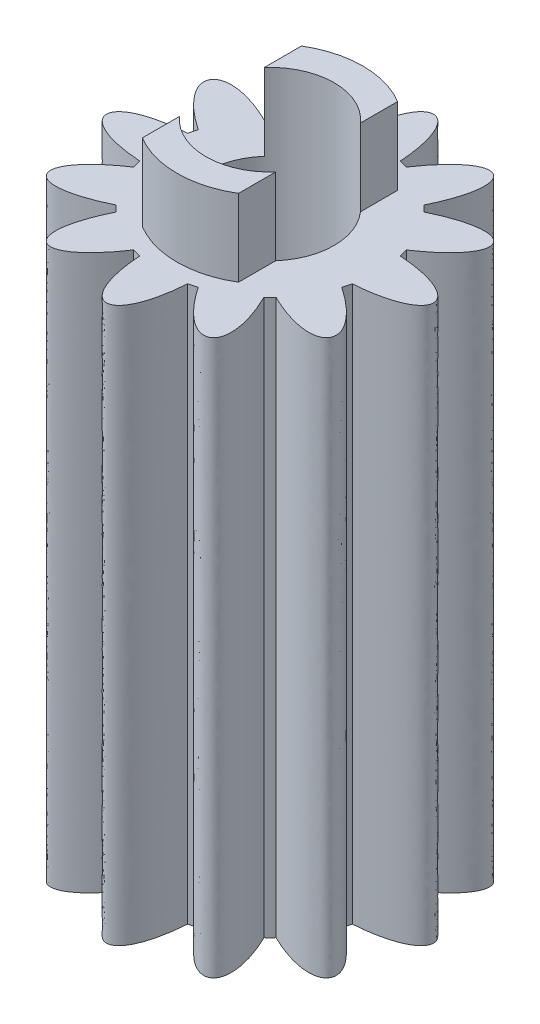
ISO-10303-21;
HEADER;
FILE_DESCRIPTION(('STEP AP214'),'2;1');
FILE_NAME('part.step','',(''),(''),'','','');
FILE_SCHEMA(('AUTOMOTIVE_DESIGN { 1 0 10303 214 1 1 1 1 }'));
ENDSEC;
DATA;
#1=APPLICATION_CONTEXT('core data for automotive mechanical design processes');
#2=APPLICATION_PROTOCOL_DEFINITION('international standard','automotive_design',2000,#1);
#3=PRODUCT_CONTEXT('',#1,'mechanical');
#4=PRODUCT('Part','Part','',(#3));
#5=PRODUCT_RELATED_PRODUCT_CATEGORY('part','',(#4));
#6=PRODUCT_DEFINITION_FORMATION('','',#4);
#7=PRODUCT_DEFINITION_CONTEXT('part definition',#1,'design');
#8=PRODUCT_DEFINITION('design','',#6,#7);
#9=PRODUCT_DEFINITION_SHAPE('','',#8);
#10=(LENGTH_UNIT() NAMED_UNIT(*) SI_UNIT(.MILLI.,.METRE.));
#11=(NAMED_UNIT(*) PLANE_ANGLE_UNIT() SI_UNIT($,.RADIAN.));
#12=(NAMED_UNIT(*) SI_UNIT($,.STERADIAN.) SOLID_ANGLE_UNIT());
#13=UNCERTAINTY_MEASURE_WITH_UNIT(LENGTH_MEASURE(1.E-05),#10,'distance_accuracy_value','');
#14=(GEOMETRIC_REPRESENTATION_CONTEXT(3) GLOBAL_UNCERTAINTY_ASSIGNED_CONTEXT((#13)) GLOBAL_UNIT_ASSIGNED_CONTEXT((#10,
#11,#12)) REPRESENTATION_CONTEXT('',''));
#15=CARTESIAN_POINT('',(0.,0.,0.));
#16=DIRECTION('',(0.,0.,1.));
#17=DIRECTION('',(1.,0.,0.));
#18=AXIS2_PLACEMENT_3D('',#15,#16,#17);
#19=CARTESIAN_POINT('',(0.,19.7,0.));
#20=DIRECTION('',(0.,-1.,0.));
#21=DIRECTION('',(0.,0.,-1.));
#22=AXIS2_PLACEMENT_3D('',#19,#20,#21);
#23=CYLINDRICAL_SURFACE('',#22,2.9);
#24=DIRECTION('',(0.,-1.,0.));
#25=VECTOR('',#24,1.);
#26=CARTESIAN_POINT('',(-1.5,19.7,-2.48193472919817));
#27=LINE('',#26,#25);
#28=CARTESIAN_POINT('',(-1.5,19.7,-2.48193472919817));
#29=VERTEX_POINT('',#28);
#30=CARTESIAN_POINT('',(-1.5,17.3,-2.48193472919817));
#31=VERTEX_POINT('',#30);
#32=EDGE_CURVE('E614',#29,#31,#27,.T.);
#33=ORIENTED_EDGE('',*,*,#32,.F.);
#34=CARTESIAN_POINT('',(0.,19.7,0.));
#35=DIRECTION('',(0.,1.,0.));
#36=DIRECTION('',(0.,0.,1.));
#37=AXIS2_PLACEMENT_3D('',#34,#35,#36);
#38=CIRCLE('',#37,2.9);
#39=CARTESIAN_POINT('',(1.5,19.7,-2.48193472919817));
#40=VERTEX_POINT('',#39);
#41=EDGE_CURVE('E261',#40,#29,#38,.T.);
#42=ORIENTED_EDGE('',*,*,#41,.F.);
#43=DIRECTION('',(0.,-1.,0.));
#44=VECTOR('',#43,1.);
#45=CARTESIAN_POINT('',(1.5,19.7,-2.48193472919817));
#46=LINE('',#45,#44);
#47=CARTESIAN_POINT('',(1.5,17.3,-2.48193472919817));
#48=VERTEX_POINT('',#47);
#49=EDGE_CURVE('E247',#48,#40,#46,.F.);
#50=ORIENTED_EDGE('',*,*,#49,.F.);
#51=CARTESIAN_POINT('',(0.,17.3,0.));
#52=DIRECTION('',(0.,1.,0.));
#53=DIRECTION('',(0.,0.,1.));
#54=AXIS2_PLACEMENT_3D('',#51,#52,#53);
#55=CIRCLE('',#54,2.9);
#56=EDGE_CURVE('E259',#48,#31,#55,.T.);
#57=ORIENTED_EDGE('',*,*,#56,.T.);
#58=EDGE_LOOP('',(#33,#42,#50,#57));
#59=FACE_BOUND('',#58,.T.);
#60=ADVANCED_FACE('F39',(#59),#23,.T.);
#61=DIRECTION('',(0.,-1.,0.));
#62=VECTOR('',#61,1.);
#63=CARTESIAN_POINT('',(-1.5,19.7,2.48193472919817));
#64=LINE('',#63,#62);
#65=CARTESIAN_POINT('',(-1.5,17.3,2.48193472919817));
#66=VERTEX_POINT('',#65);
#67=CARTESIAN_POINT('',(-1.5,19.7,2.48193472919817));
#68=VERTEX_POINT('',#67);
#69=EDGE_CURVE('E624',#66,#68,#64,.F.);
#70=ORIENTED_EDGE('',*,*,#69,.F.);
#71=CARTESIAN_POINT('',(1.5,17.3,2.48193472919817));
#72=VERTEX_POINT('',#71);
#73=EDGE_CURVE('E270',#66,#72,#55,.T.);
#74=ORIENTED_EDGE('',*,*,#73,.T.);
#75=DIRECTION('',(0.,-1.,0.));
#76=VECTOR('',#75,1.);
#77=CARTESIAN_POINT('',(1.5,19.7,2.48193472919817));
#78=LINE('',#77,#76);
#79=CARTESIAN_POINT('',(1.5,19.7,2.48193472919817));
#80=VERTEX_POINT('',#79);
#81=EDGE_CURVE('E262',#80,#72,#78,.T.);
#82=ORIENTED_EDGE('',*,*,#81,.F.);
#83=EDGE_CURVE('E277',#68,#80,#38,.T.);
#84=ORIENTED_EDGE('',*,*,#83,.F.);
#85=EDGE_LOOP('',(#70,#74,#82,#84));
#86=FACE_BOUND('',#85,.T.);
#87=ADVANCED_FACE('F737',(#86),#23,.T.);
#88=CARTESIAN_POINT('',(0.,19.7,0.));
#89=DIRECTION('',(0.,1.,0.));
#90=DIRECTION('',(0.,0.,1.));
#91=AXIS2_PLACEMENT_3D('',#88,#89,#90);
#92=PLANE('',#91);
#93=ORIENTED_EDGE('',*,*,#41,.T.);
#94=DIRECTION('',(0.,0.,-1.));
#95=VECTOR('',#94,1.);
#96=CARTESIAN_POINT('',(-1.5,19.7,-6.));
#97=LINE('',#96,#95);
#98=CARTESIAN_POINT('',(-1.5,19.7,-1.3228756555323));
#99=VERTEX_POINT('',#98);
#100=EDGE_CURVE('E616',#99,#29,#97,.T.);
#101=ORIENTED_EDGE('',*,*,#100,.F.);
#102=CARTESIAN_POINT('',(0.,19.7,0.));
#103=DIRECTION('',(0.,-1.,0.));
#104=DIRECTION('',(0.,0.,-1.));
#105=AXIS2_PLACEMENT_3D('',#102,#103,#104);
#106=CIRCLE('',#105,2.);
#107=CARTESIAN_POINT('',(1.5,19.7,-1.3228756555323));
#108=VERTEX_POINT('',#107);
#109=EDGE_CURVE('E628',#99,#108,#106,.T.);
#110=ORIENTED_EDGE('',*,*,#109,.T.);
#111=DIRECTION('',(0.,0.,1.));
#112=VECTOR('',#111,1.);
#113=CARTESIAN_POINT('',(1.5,19.7,-6.));
#114=LINE('',#113,#112);
#115=EDGE_CURVE('E620',#40,#108,#114,.T.);
#116=ORIENTED_EDGE('',*,*,#115,.F.);
#117=EDGE_LOOP('',(#93,#101,#110,#116));
#118=FACE_BOUND('',#117,.T.);
#119=ADVANCED_FACE('F742',(#118),#92,.T.);
#120=CARTESIAN_POINT('',(1.5,19.7,1.3228756555323));
#121=VERTEX_POINT('',#120);
#122=CARTESIAN_POINT('',(-1.5,19.7,1.3228756555323));
#123=VERTEX_POINT('',#122);
#124=EDGE_CURVE('E630',#121,#123,#106,.T.);
#125=ORIENTED_EDGE('',*,*,#124,.T.);
#126=EDGE_CURVE('E263',#68,#123,#97,.T.);
#127=ORIENTED_EDGE('',*,*,#126,.F.);
#128=ORIENTED_EDGE('',*,*,#83,.T.);
#129=EDGE_CURVE('E621',#121,#80,#114,.T.);
#130=ORIENTED_EDGE('',*,*,#129,.F.);
#131=EDGE_LOOP('',(#125,#127,#128,#130));
#132=FACE_BOUND('',#131,.T.);
#133=ADVANCED_FACE('F824',(#132),#92,.T.);
#134=CARTESIAN_POINT('',(0.,19.7,0.));
#135=DIRECTION('',(0.,-1.,0.));
#136=DIRECTION('',(0.,0.,-1.));
#137=AXIS2_PLACEMENT_3D('',#134,#135,#136);
#138=CYLINDRICAL_SURFACE('',#137,2.);
#139=CARTESIAN_POINT('',(0.,0.,0.));
#140=DIRECTION('',(0.,-1.,0.));
#141=DIRECTION('',(0.,0.,-1.));
#142=AXIS2_PLACEMENT_3D('',#139,#140,#141);
#143=CIRCLE('',#142,2.);
#144=CARTESIAN_POINT('',(0.,0.,-2.));
#145=VERTEX_POINT('',#144);
#146=EDGE_CURVE('E627',#145,#145,#143,.T.);
#147=ORIENTED_EDGE('',*,*,#146,.T.);
#148=EDGE_LOOP('',(#147));
#149=FACE_BOUND('',#148,.T.);
#150=DIRECTION('',(0.,-1.,0.));
#151=VECTOR('',#150,1.);
#152=CARTESIAN_POINT('',(-1.5,19.7,-1.3228756555323));
#153=LINE('',#152,#151);
#154=CARTESIAN_POINT('',(-1.5,17.3,-1.3228756555323));
#155=VERTEX_POINT('',#154);
#156=EDGE_CURVE('E11',#155,#99,#153,.F.);
#157=ORIENTED_EDGE('',*,*,#156,.F.);
#158=CARTESIAN_POINT('',(0.,17.3,0.));
#159=DIRECTION('',(0.,-1.,0.));
#160=DIRECTION('',(0.,0.,-1.));
#161=AXIS2_PLACEMENT_3D('',#158,#159,#160);
#162=CIRCLE('',#161,2.);
#163=CARTESIAN_POINT('',(-1.5,17.3,1.3228756555323));
#164=VERTEX_POINT('',#163);
#165=EDGE_CURVE('E598',#155,#164,#162,.F.);
#166=ORIENTED_EDGE('',*,*,#165,.T.);
#167=DIRECTION('',(0.,-1.,0.));
#168=VECTOR('',#167,1.);
#169=CARTESIAN_POINT('',(-1.5,19.7,1.3228756555323));
#170=LINE('',#169,#168);
#171=EDGE_CURVE('E48',#123,#164,#170,.T.);
#172=ORIENTED_EDGE('',*,*,#171,.F.);
#173=ORIENTED_EDGE('',*,*,#124,.F.);
#174=DIRECTION('',(0.,-1.,0.));
#175=VECTOR('',#174,1.);
#176=CARTESIAN_POINT('',(1.5,19.7,1.3228756555323));
#177=LINE('',#176,#175);
#178=CARTESIAN_POINT('',(1.5,17.3,1.3228756555323));
#179=VERTEX_POINT('',#178);
#180=EDGE_CURVE('E596',#179,#121,#177,.F.);
#181=ORIENTED_EDGE('',*,*,#180,.F.);
#182=CARTESIAN_POINT('',(0.,17.3,0.));
#183=DIRECTION('',(0.,-1.,0.));
#184=DIRECTION('',(0.,0.,-1.));
#185=AXIS2_PLACEMENT_3D('',#182,#183,#184);
#186=CIRCLE('',#185,2.);
#187=CARTESIAN_POINT('',(1.5,17.3,-1.3228756555323));
#188=VERTEX_POINT('',#187);
#189=EDGE_CURVE('E269',#179,#188,#186,.F.);
#190=ORIENTED_EDGE('',*,*,#189,.T.);
#191=DIRECTION('',(0.,-1.,0.));
#192=VECTOR('',#191,1.);
#193=CARTESIAN_POINT('',(1.5,19.7,-1.3228756555323));
#194=LINE('',#193,#192);
#195=EDGE_CURVE('E250',#108,#188,#194,.T.);
#196=ORIENTED_EDGE('',*,*,#195,.F.);
#197=ORIENTED_EDGE('',*,*,#109,.F.);
#198=EDGE_LOOP('',(#157,#166,#172,#173,#181,#190,#196,#197));
#199=FACE_BOUND('',#198,.T.);
#200=ADVANCED_FACE('F609',(#149,#199),#138,.F.);
#201=CARTESIAN_POINT('',(0.,17.3,0.));
#202=DIRECTION('',(0.,-1.,0.));
#203=DIRECTION('',(0.,0.,-1.));
#204=AXIS2_PLACEMENT_3D('',#201,#202,#203);
#205=CYLINDRICAL_SURFACE('',#204,3.4);
#206=CARTESIAN_POINT('',(0.,0.,0.));
#207=DIRECTION('',(0.,1.,0.));
#208=DIRECTION('',(0.,0.,1.));
#209=AXIS2_PLACEMENT_3D('',#206,#207,#208);
#210=CIRCLE('',#209,3.4);
#211=CARTESIAN_POINT('',(0.749999999999977,0.,3.31624787975809));
#212=VERTEX_POINT('',#211);
#213=CARTESIAN_POINT('',(1.0086048870407,0.,3.24695490911679));
#214=VERTEX_POINT('',#213);
#215=EDGE_CURVE('E437',#212,#214,#210,.T.);
#216=ORIENTED_EDGE('',*,*,#215,.T.);
#217=DIRECTION('',(0.,-1.,0.));
#218=VECTOR('',#217,1.);
#219=CARTESIAN_POINT('',(1.0086048870407,17.3,3.24695490911679));
#220=LINE('',#219,#218);
#221=CARTESIAN_POINT('',(1.0086048870407,17.3,3.24695490911679));
#222=VERTEX_POINT('',#221);
#223=EDGE_CURVE('E274',#222,#214,#220,.T.);
#224=ORIENTED_EDGE('',*,*,#223,.F.);
#225=CARTESIAN_POINT('',(0.,17.3,0.));
#226=DIRECTION('',(0.,1.,0.));
#227=DIRECTION('',(0.,0.,1.));
#228=AXIS2_PLACEMENT_3D('',#225,#226,#227);
#229=CIRCLE('',#228,3.4);
#230=CARTESIAN_POINT('',(0.749999999999977,17.3,3.31624787975809));
#231=VERTEX_POINT('',#230);
#232=EDGE_CURVE('E279',#231,#222,#229,.T.);
#233=ORIENTED_EDGE('',*,*,#232,.F.);
#234=DIRECTION('',(0.,-1.,0.));
#235=VECTOR('',#234,1.);
#236=CARTESIAN_POINT('',(0.749999999999977,17.3,3.31624787975809));
#237=LINE('',#236,#235);
#238=EDGE_CURVE('E436',#231,#212,#237,.T.);
#239=ORIENTED_EDGE('',*,*,#238,.T.);
#240=EDGE_LOOP('',(#216,#224,#233,#239));
#241=FACE_BOUND('',#240,.T.);
#242=ADVANCED_FACE('F424',(#241),#205,.T.);
#243=CARTESIAN_POINT('',(2.30764299271736,17.3,2.4969549091168));
#244=CARTESIAN_POINT('',(3.35247350558122,17.3,4.63998777602861));
#245=CARTESIAN_POINT('',(2.34211053449937,17.3,5.22332110936194));
#246=CARTESIAN_POINT('',(1.0086048870407,17.3,3.24695490911679));
#247=B_SPLINE_CURVE_WITH_KNOTS('',3,(#243,#244,#245,#246),.UNSPECIFIED.,.F.,.F.,(4,4),(0.,1.),.UNSPECIFIED.);
#248=DIRECTION('',(0.,-1.,0.));
#249=VECTOR('',#248,1.);
#250=SURFACE_OF_LINEAR_EXTRUSION('',#247,#249);
#251=CARTESIAN_POINT('',(2.30764299271736,0.,2.4969549091168));
#252=CARTESIAN_POINT('',(3.35247350558122,0.,4.63998777602861));
#253=CARTESIAN_POINT('',(2.34211053449937,0.,5.22332110936194));
#254=CARTESIAN_POINT('',(1.0086048870407,0.,3.24695490911679));
#255=B_SPLINE_CURVE_WITH_KNOTS('',3,(#251,#252,#253,#254),.UNSPECIFIED.,.F.,.F.,(4,4),(0.,1.),.UNSPECIFIED.);
#256=CARTESIAN_POINT('',(2.30764299271736,0.,2.4969549091168));
#257=VERTEX_POINT('',#256);
#258=EDGE_CURVE('E443',#257,#214,#255,.T.);
#259=ORIENTED_EDGE('',*,*,#258,.F.);
#260=DIRECTION('',(0.,-1.,0.));
#261=VECTOR('',#260,1.);
#262=CARTESIAN_POINT('',(2.30764299271736,17.3,2.4969549091168));
#263=LINE('',#262,#261);
#264=CARTESIAN_POINT('',(2.30764299271736,17.3,2.4969549091168));
#265=VERTEX_POINT('',#264);
#266=EDGE_CURVE('E592',#265,#257,#263,.T.);
#267=ORIENTED_EDGE('',*,*,#266,.F.);
#268=EDGE_CURVE('E281',#265,#222,#247,.T.);
#269=ORIENTED_EDGE('',*,*,#268,.T.);
#270=ORIENTED_EDGE('',*,*,#223,.T.);
#271=EDGE_LOOP('',(#259,#267,#269,#270));
#272=FACE_BOUND('',#271,.T.);
#273=ADVANCED_FACE('F41',(#272),#250,.T.);
#274=CARTESIAN_POINT('',(2.49695490911677,0.,2.30764299271738));
#275=VERTEX_POINT('',#274);
#276=EDGE_CURVE('E445',#257,#275,#210,.T.);
#277=ORIENTED_EDGE('',*,*,#276,.T.);
#278=DIRECTION('',(0.,-1.,0.));
#279=VECTOR('',#278,1.);
#280=CARTESIAN_POINT('',(2.49695490911677,17.3,2.30764299271738));
#281=LINE('',#280,#279);
#282=CARTESIAN_POINT('',(2.49695490911677,17.3,2.30764299271738));
#283=VERTEX_POINT('',#282);
#284=EDGE_CURVE('E590',#283,#275,#281,.T.);
#285=ORIENTED_EDGE('',*,*,#284,.F.);
#286=EDGE_CURVE('E284',#265,#283,#229,.T.);
#287=ORIENTED_EDGE('',*,*,#286,.F.);
#288=ORIENTED_EDGE('',*,*,#266,.T.);
#289=EDGE_LOOP('',(#277,#285,#287,#288));
#290=FACE_BOUND('',#289,.T.);
#291=ADVANCED_FACE('F310',(#290),#205,.T.);
#292=CARTESIAN_POINT('',(3.24695490911678,17.3,1.00860488704073));
#293=CARTESIAN_POINT('',(5.22332110936191,17.3,2.34211053449942));
#294=CARTESIAN_POINT('',(4.63998777602857,17.3,3.35247350558126));
#295=CARTESIAN_POINT('',(2.49695490911677,17.3,2.30764299271738));
#296=B_SPLINE_CURVE_WITH_KNOTS('',3,(#292,#293,#294,#295),.UNSPECIFIED.,.F.,.F.,(4,4),(0.,1.),.UNSPECIFIED.);
#297=DIRECTION('',(0.,-1.,0.));
#298=VECTOR('',#297,1.);
#299=SURFACE_OF_LINEAR_EXTRUSION('',#296,#298);
#300=CARTESIAN_POINT('',(3.24695490911678,0.,1.00860488704073));
#301=CARTESIAN_POINT('',(5.22332110936191,0.,2.34211053449942));
#302=CARTESIAN_POINT('',(4.63998777602857,0.,3.35247350558126));
#303=CARTESIAN_POINT('',(2.49695490911677,0.,2.30764299271738));
#304=B_SPLINE_CURVE_WITH_KNOTS('',3,(#300,#301,#302,#303),.UNSPECIFIED.,.F.,.F.,(4,4),(0.,1.),.UNSPECIFIED.);
#305=CARTESIAN_POINT('',(3.24695490911678,0.,1.00860488704073));
#306=VERTEX_POINT('',#305);
#307=EDGE_CURVE('E450',#306,#275,#304,.T.);
#308=ORIENTED_EDGE('',*,*,#307,.F.);
#309=DIRECTION('',(0.,-1.,0.));
#310=VECTOR('',#309,1.);
#311=CARTESIAN_POINT('',(3.24695490911678,17.3,1.00860488704073));
#312=LINE('',#311,#310);
#313=CARTESIAN_POINT('',(3.24695490911678,17.3,1.00860488704073));
#314=VERTEX_POINT('',#313);
#315=EDGE_CURVE('E588',#314,#306,#312,.T.);
#316=ORIENTED_EDGE('',*,*,#315,.F.);
#317=EDGE_CURVE('E289',#314,#283,#296,.T.);
#318=ORIENTED_EDGE('',*,*,#317,.T.);
#319=ORIENTED_EDGE('',*,*,#284,.T.);
#320=EDGE_LOOP('',(#308,#316,#318,#319));
#321=FACE_BOUND('',#320,.T.);
#322=ADVANCED_FACE('F306',(#321),#299,.T.);
#323=CARTESIAN_POINT('',(3.31624787975808,0.,0.750000000000012));
#324=VERTEX_POINT('',#323);
#325=EDGE_CURVE('E458',#306,#324,#210,.T.);
#326=ORIENTED_EDGE('',*,*,#325,.T.);
#327=DIRECTION('',(0.,-1.,0.));
#328=VECTOR('',#327,1.);
#329=CARTESIAN_POINT('',(3.31624787975808,17.3,0.750000000000012));
#330=LINE('',#329,#328);
#331=CARTESIAN_POINT('',(3.31624787975808,17.3,0.750000000000012));
#332=VERTEX_POINT('',#331);
#333=EDGE_CURVE('E586',#332,#324,#330,.T.);
#334=ORIENTED_EDGE('',*,*,#333,.F.);
#335=EDGE_CURVE('E297',#314,#332,#229,.T.);
#336=ORIENTED_EDGE('',*,*,#335,.F.);
#337=ORIENTED_EDGE('',*,*,#315,.T.);
#338=EDGE_LOOP('',(#326,#334,#336,#337));
#339=FACE_BOUND('',#338,.T.);
#340=ADVANCED_FACE('F309',(#339),#205,.T.);
#341=CARTESIAN_POINT('',(3.31624787975809,17.3,-0.749999999999988));
#342=CARTESIAN_POINT('',(5.69458404008064,17.3,-0.583333333333314));
#343=CARTESIAN_POINT('',(5.69458404008063,17.3,0.583333333333354));
#344=CARTESIAN_POINT('',(3.31624787975808,17.3,0.750000000000011));
#345=B_SPLINE_CURVE_WITH_KNOTS('',3,(#341,#342,#343,#344),.UNSPECIFIED.,.F.,.F.,(4,4),(0.,1.),.UNSPECIFIED.);
#346=DIRECTION('',(0.,-1.,0.));
#347=VECTOR('',#346,1.);
#348=SURFACE_OF_LINEAR_EXTRUSION('',#345,#347);
#349=CARTESIAN_POINT('',(3.31624787975809,0.,-0.749999999999988));
#350=CARTESIAN_POINT('',(5.69458404008064,0.,-0.583333333333314));
#351=CARTESIAN_POINT('',(5.69458404008063,0.,0.583333333333354));
#352=CARTESIAN_POINT('',(3.31624787975808,0.,0.750000000000011));
#353=B_SPLINE_CURVE_WITH_KNOTS('',3,(#349,#350,#351,#352),.UNSPECIFIED.,.F.,.F.,(4,4),(0.,1.),.UNSPECIFIED.);
#354=CARTESIAN_POINT('',(3.31624787975809,0.,-0.749999999999988));
#355=VERTEX_POINT('',#354);
#356=EDGE_CURVE('E459',#355,#324,#353,.T.);
#357=ORIENTED_EDGE('',*,*,#356,.F.);
#358=DIRECTION('',(0.,-1.,0.));
#359=VECTOR('',#358,1.);
#360=CARTESIAN_POINT('',(3.31624787975809,17.3,-0.749999999999988));
#361=LINE('',#360,#359);
#362=CARTESIAN_POINT('',(3.31624787975809,17.3,-0.749999999999988));
#363=VERTEX_POINT('',#362);
#364=EDGE_CURVE('E584',#363,#355,#361,.T.);
#365=ORIENTED_EDGE('',*,*,#364,.F.);
#366=EDGE_CURVE('E298',#363,#332,#345,.T.);
#367=ORIENTED_EDGE('',*,*,#366,.T.);
#368=ORIENTED_EDGE('',*,*,#333,.T.);
#369=EDGE_LOOP('',(#357,#365,#367,#368));
#370=FACE_BOUND('',#369,.T.);
#371=ADVANCED_FACE('F312',(#370),#348,.T.);
#372=CARTESIAN_POINT('',(3.24695490911679,0.,-1.00860488704071));
#373=VERTEX_POINT('',#372);
#374=EDGE_CURVE('E467',#355,#373,#210,.T.);
#375=ORIENTED_EDGE('',*,*,#374,.T.);
#376=DIRECTION('',(0.,-1.,0.));
#377=VECTOR('',#376,1.);
#378=CARTESIAN_POINT('',(3.24695490911679,17.3,-1.00860488704071));
#379=LINE('',#378,#377);
#380=CARTESIAN_POINT('',(3.24695490911679,17.3,-1.00860488704071));
#381=VERTEX_POINT('',#380);
#382=EDGE_CURVE('E582',#381,#373,#379,.T.);
#383=ORIENTED_EDGE('',*,*,#382,.F.);
#384=EDGE_CURVE('E330',#363,#381,#229,.T.);
#385=ORIENTED_EDGE('',*,*,#384,.F.);
#386=ORIENTED_EDGE('',*,*,#364,.T.);
#387=EDGE_LOOP('',(#375,#383,#385,#386));
#388=FACE_BOUND('',#387,.T.);
#389=ADVANCED_FACE('F315',(#388),#205,.T.);
#390=CARTESIAN_POINT('',(2.49695490911679,17.3,-2.30764299271737));
#391=CARTESIAN_POINT('',(4.63998777602859,17.3,-3.35247350558123));
#392=CARTESIAN_POINT('',(5.22332110936193,17.3,-2.34211053449938));
#393=CARTESIAN_POINT('',(3.24695490911678,17.3,-1.00860488704071));
#394=B_SPLINE_CURVE_WITH_KNOTS('',3,(#390,#391,#392,#393),.UNSPECIFIED.,.F.,.F.,(4,4),(0.,1.),.UNSPECIFIED.);
#395=DIRECTION('',(0.,-1.,0.));
#396=VECTOR('',#395,1.);
#397=SURFACE_OF_LINEAR_EXTRUSION('',#394,#396);
#398=CARTESIAN_POINT('',(2.49695490911679,0.,-2.30764299271737));
#399=CARTESIAN_POINT('',(4.63998777602859,0.,-3.35247350558123));
#400=CARTESIAN_POINT('',(5.22332110936193,0.,-2.34211053449938));
#401=CARTESIAN_POINT('',(3.24695490911678,0.,-1.00860488704071));
#402=B_SPLINE_CURVE_WITH_KNOTS('',3,(#398,#399,#400,#401),.UNSPECIFIED.,.F.,.F.,(4,4),(0.,1.),.UNSPECIFIED.);
#403=CARTESIAN_POINT('',(2.49695490911679,0.,-2.30764299271737));
#404=VERTEX_POINT('',#403);
#405=EDGE_CURVE('E468',#404,#373,#402,.T.);
#406=ORIENTED_EDGE('',*,*,#405,.F.);
#407=DIRECTION('',(0.,-1.,0.));
#408=VECTOR('',#407,1.);
#409=CARTESIAN_POINT('',(2.49695490911679,17.3,-2.30764299271737));
#410=LINE('',#409,#408);
#411=CARTESIAN_POINT('',(2.49695490911679,17.3,-2.30764299271737));
#412=VERTEX_POINT('',#411);
#413=EDGE_CURVE('E580',#412,#404,#410,.T.);
#414=ORIENTED_EDGE('',*,*,#413,.F.);
#415=EDGE_CURVE('E325',#412,#381,#394,.T.);
#416=ORIENTED_EDGE('',*,*,#415,.T.);
#417=ORIENTED_EDGE('',*,*,#382,.T.);
#418=EDGE_LOOP('',(#406,#414,#416,#417));
#419=FACE_BOUND('',#418,.T.);
#420=ADVANCED_FACE('F317',(#419),#397,.T.);
#421=CARTESIAN_POINT('',(2.30764299271737,0.,-2.49695490911678));
#422=VERTEX_POINT('',#421);
#423=EDGE_CURVE('E476',#404,#422,#210,.T.);
#424=ORIENTED_EDGE('',*,*,#423,.T.);
#425=DIRECTION('',(0.,-1.,0.));
#426=VECTOR('',#425,1.);
#427=CARTESIAN_POINT('',(2.30764299271737,17.3,-2.49695490911678));
#428=LINE('',#427,#426);
#429=CARTESIAN_POINT('',(2.30764299271737,17.3,-2.49695490911678));
#430=VERTEX_POINT('',#429);
#431=EDGE_CURVE('E578',#430,#422,#428,.T.);
#432=ORIENTED_EDGE('',*,*,#431,.F.);
#433=EDGE_CURVE('E329',#412,#430,#229,.T.);
#434=ORIENTED_EDGE('',*,*,#433,.F.);
#435=ORIENTED_EDGE('',*,*,#413,.T.);
#436=EDGE_LOOP('',(#424,#432,#434,#435));
#437=FACE_BOUND('',#436,.T.);
#438=ADVANCED_FACE('F320',(#437),#205,.T.);
#439=CARTESIAN_POINT('',(1.00860488704072,17.3,-3.24695490911678));
#440=CARTESIAN_POINT('',(2.3421105344994,17.3,-5.22332110936192));
#441=CARTESIAN_POINT('',(3.35247350558125,17.3,-4.63998777602858));
#442=CARTESIAN_POINT('',(2.30764299271737,17.3,-2.49695490911678));
#443=B_SPLINE_CURVE_WITH_KNOTS('',3,(#439,#440,#441,#442),.UNSPECIFIED.,.F.,.F.,(4,4),(0.,1.),.UNSPECIFIED.);
#444=DIRECTION('',(0.,-1.,0.));
#445=VECTOR('',#444,1.);
#446=SURFACE_OF_LINEAR_EXTRUSION('',#443,#445);
#447=CARTESIAN_POINT('',(1.00860488704072,0.,-3.24695490911678));
#448=CARTESIAN_POINT('',(2.3421105344994,0.,-5.22332110936192));
#449=CARTESIAN_POINT('',(3.35247350558125,0.,-4.63998777602858));
#450=CARTESIAN_POINT('',(2.30764299271737,0.,-2.49695490911678));
#451=B_SPLINE_CURVE_WITH_KNOTS('',3,(#447,#448,#449,#450),.UNSPECIFIED.,.F.,.F.,(4,4),(0.,1.),.UNSPECIFIED.);
#452=CARTESIAN_POINT('',(1.00860488704072,0.,-3.24695490911678));
#453=VERTEX_POINT('',#452);
#454=EDGE_CURVE('E477',#453,#422,#451,.T.);
#455=ORIENTED_EDGE('',*,*,#454,.F.);
#456=DIRECTION('',(0.,-1.,0.));
#457=VECTOR('',#456,1.);
#458=CARTESIAN_POINT('',(1.00860488704072,17.3,-3.24695490911678));
#459=LINE('',#458,#457);
#460=CARTESIAN_POINT('',(1.00860488704072,17.3,-3.24695490911678));
#461=VERTEX_POINT('',#460);
#462=EDGE_CURVE('E576',#461,#453,#459,.T.);
#463=ORIENTED_EDGE('',*,*,#462,.F.);
#464=EDGE_CURVE('E331',#461,#430,#443,.T.);
#465=ORIENTED_EDGE('',*,*,#464,.T.);
#466=ORIENTED_EDGE('',*,*,#431,.T.);
#467=EDGE_LOOP('',(#455,#463,#465,#466));
#468=FACE_BOUND('',#467,.T.);
#469=ADVANCED_FACE('F322',(#468),#446,.T.);
#470=CARTESIAN_POINT('',(0.75,0.,-3.31624787975809));
#471=VERTEX_POINT('',#470);
#472=EDGE_CURVE('E485',#453,#471,#210,.T.);
#473=ORIENTED_EDGE('',*,*,#472,.T.);
#474=DIRECTION('',(0.,-1.,0.));
#475=VECTOR('',#474,1.);
#476=CARTESIAN_POINT('',(0.75,17.3,-3.31624787975809));
#477=LINE('',#476,#475);
#478=CARTESIAN_POINT('',(0.75,17.3,-3.31624787975809));
#479=VERTEX_POINT('',#478);
#480=EDGE_CURVE('E574',#479,#471,#477,.T.);
#481=ORIENTED_EDGE('',*,*,#480,.F.);
#482=EDGE_CURVE('E339',#461,#479,#229,.T.);
#483=ORIENTED_EDGE('',*,*,#482,.F.);
#484=ORIENTED_EDGE('',*,*,#462,.T.);
#485=EDGE_LOOP('',(#473,#481,#483,#484));
#486=FACE_BOUND('',#485,.T.);
#487=ADVANCED_FACE('F362',(#486),#205,.T.);
#488=CARTESIAN_POINT('',(-0.75,17.3,-3.31624787975809));
#489=CARTESIAN_POINT('',(-0.583333333333333,17.3,-5.69458404008064));
#490=CARTESIAN_POINT('',(0.583333333333334,17.3,-5.69458404008064));
#491=CARTESIAN_POINT('',(0.75,17.3,-3.31624787975808));
#492=B_SPLINE_CURVE_WITH_KNOTS('',3,(#488,#489,#490,#491),.UNSPECIFIED.,.F.,.F.,(4,4),(0.,1.),.UNSPECIFIED.);
#493=DIRECTION('',(0.,-1.,0.));
#494=VECTOR('',#493,1.);
#495=SURFACE_OF_LINEAR_EXTRUSION('',#492,#494);
#496=CARTESIAN_POINT('',(-0.75,0.,-3.31624787975809));
#497=CARTESIAN_POINT('',(-0.583333333333333,0.,-5.69458404008064));
#498=CARTESIAN_POINT('',(0.583333333333334,0.,-5.69458404008064));
#499=CARTESIAN_POINT('',(0.75,0.,-3.31624787975808));
#500=B_SPLINE_CURVE_WITH_KNOTS('',3,(#496,#497,#498,#499),.UNSPECIFIED.,.F.,.F.,(4,4),(0.,1.),.UNSPECIFIED.);
#501=CARTESIAN_POINT('',(-0.75,0.,-3.31624787975809));
#502=VERTEX_POINT('',#501);
#503=EDGE_CURVE('E486',#502,#471,#500,.T.);
#504=ORIENTED_EDGE('',*,*,#503,.F.);
#505=DIRECTION('',(0.,-1.,0.));
#506=VECTOR('',#505,1.);
#507=CARTESIAN_POINT('',(-0.75,17.3,-3.31624787975809));
#508=LINE('',#507,#506);
#509=CARTESIAN_POINT('',(-0.75,17.3,-3.31624787975809));
#510=VERTEX_POINT('',#509);
#511=EDGE_CURVE('E572',#510,#502,#508,.T.);
#512=ORIENTED_EDGE('',*,*,#511,.F.);
#513=EDGE_CURVE('E340',#510,#479,#492,.T.);
#514=ORIENTED_EDGE('',*,*,#513,.T.);
#515=ORIENTED_EDGE('',*,*,#480,.T.);
#516=EDGE_LOOP('',(#504,#512,#514,#515));
#517=FACE_BOUND('',#516,.T.);
#518=ADVANCED_FACE('F358',(#517),#495,.T.);
#519=CARTESIAN_POINT('',(-1.00860488704067,0.,-3.2469549091168));
#520=VERTEX_POINT('',#519);
#521=EDGE_CURVE('E494',#502,#520,#210,.T.);
#522=ORIENTED_EDGE('',*,*,#521,.T.);
#523=DIRECTION('',(0.,-1.,0.));
#524=VECTOR('',#523,1.);
#525=CARTESIAN_POINT('',(-1.00860488704067,17.3,-3.2469549091168));
#526=LINE('',#525,#524);
#527=CARTESIAN_POINT('',(-1.00860488704067,17.3,-3.2469549091168));
#528=VERTEX_POINT('',#527);
#529=EDGE_CURVE('E570',#528,#520,#526,.T.);
#530=ORIENTED_EDGE('',*,*,#529,.F.);
#531=EDGE_CURVE('E349',#510,#528,#229,.T.);
#532=ORIENTED_EDGE('',*,*,#531,.F.);
#533=ORIENTED_EDGE('',*,*,#511,.T.);
#534=EDGE_LOOP('',(#522,#530,#532,#533));
#535=FACE_BOUND('',#534,.T.);
#536=ADVANCED_FACE('F361',(#535),#205,.T.);
#537=CARTESIAN_POINT('',(-2.30764299271734,17.3,-2.49695490911681));
#538=CARTESIAN_POINT('',(-3.35247350558118,17.3,-4.63998777602863));
#539=CARTESIAN_POINT('',(-2.34211053449933,17.3,-5.22332110936195));
#540=CARTESIAN_POINT('',(-1.00860488704067,17.3,-3.2469549091168));
#541=B_SPLINE_CURVE_WITH_KNOTS('',3,(#537,#538,#539,#540),.UNSPECIFIED.,.F.,.F.,(4,4),(0.,1.),.UNSPECIFIED.);
#542=DIRECTION('',(0.,-1.,0.));
#543=VECTOR('',#542,1.);
#544=SURFACE_OF_LINEAR_EXTRUSION('',#541,#543);
#545=CARTESIAN_POINT('',(-2.30764299271734,0.,-2.49695490911681));
#546=CARTESIAN_POINT('',(-3.35247350558118,0.,-4.63998777602863));
#547=CARTESIAN_POINT('',(-2.34211053449933,0.,-5.22332110936195));
#548=CARTESIAN_POINT('',(-1.00860488704067,0.,-3.2469549091168));
#549=B_SPLINE_CURVE_WITH_KNOTS('',3,(#545,#546,#547,#548),.UNSPECIFIED.,.F.,.F.,(4,4),(0.,1.),.UNSPECIFIED.);
#550=CARTESIAN_POINT('',(-2.30764299271734,0.,-2.49695490911681));
#551=VERTEX_POINT('',#550);
#552=EDGE_CURVE('E495',#551,#520,#549,.T.);
#553=ORIENTED_EDGE('',*,*,#552,.F.);
#554=DIRECTION('',(0.,-1.,0.));
#555=VECTOR('',#554,1.);
#556=CARTESIAN_POINT('',(-2.30764299271734,17.3,-2.49695490911681));
#557=LINE('',#556,#555);
#558=CARTESIAN_POINT('',(-2.30764299271734,17.3,-2.49695490911681));
#559=VERTEX_POINT('',#558);
#560=EDGE_CURVE('E568',#559,#551,#557,.T.);
#561=ORIENTED_EDGE('',*,*,#560,.F.);
#562=EDGE_CURVE('E350',#559,#528,#541,.T.);
#563=ORIENTED_EDGE('',*,*,#562,.T.);
#564=ORIENTED_EDGE('',*,*,#529,.T.);
#565=EDGE_LOOP('',(#553,#561,#563,#564));
#566=FACE_BOUND('',#565,.T.);
#567=ADVANCED_FACE('F364',(#566),#544,.T.);
#568=CARTESIAN_POINT('',(-2.49695490911676,0.,-2.3076429927174));
#569=VERTEX_POINT('',#568);
#570=EDGE_CURVE('E503',#551,#569,#210,.T.);
#571=ORIENTED_EDGE('',*,*,#570,.T.);
#572=DIRECTION('',(0.,-1.,0.));
#573=VECTOR('',#572,1.);
#574=CARTESIAN_POINT('',(-2.49695490911676,17.3,-2.3076429927174));
#575=LINE('',#574,#573);
#576=CARTESIAN_POINT('',(-2.49695490911676,17.3,-2.3076429927174));
#577=VERTEX_POINT('',#576);
#578=EDGE_CURVE('E566',#577,#569,#575,.T.);
#579=ORIENTED_EDGE('',*,*,#578,.F.);
#580=EDGE_CURVE('E382',#559,#577,#229,.T.);
#581=ORIENTED_EDGE('',*,*,#580,.F.);
#582=ORIENTED_EDGE('',*,*,#560,.T.);
#583=EDGE_LOOP('',(#571,#579,#581,#582));
#584=FACE_BOUND('',#583,.T.);
#585=ADVANCED_FACE('F367',(#584),#205,.T.);
#586=CARTESIAN_POINT('',(-3.24695490911677,17.3,-1.00860488704075));
#587=CARTESIAN_POINT('',(-5.22332110936189,17.3,-2.34211053449946));
#588=CARTESIAN_POINT('',(-4.63998777602855,17.3,-3.3524735055813));
#589=CARTESIAN_POINT('',(-2.49695490911676,17.3,-2.3076429927174));
#590=B_SPLINE_CURVE_WITH_KNOTS('',3,(#586,#587,#588,#589),.UNSPECIFIED.,.F.,.F.,(4,4),(0.,1.),.UNSPECIFIED.);
#591=DIRECTION('',(0.,-1.,0.));
#592=VECTOR('',#591,1.);
#593=SURFACE_OF_LINEAR_EXTRUSION('',#590,#592);
#594=CARTESIAN_POINT('',(-3.24695490911677,0.,-1.00860488704075));
#595=CARTESIAN_POINT('',(-5.22332110936189,0.,-2.34211053449946));
#596=CARTESIAN_POINT('',(-4.63998777602855,0.,-3.3524735055813));
#597=CARTESIAN_POINT('',(-2.49695490911676,0.,-2.3076429927174));
#598=B_SPLINE_CURVE_WITH_KNOTS('',3,(#594,#595,#596,#597),.UNSPECIFIED.,.F.,.F.,(4,4),(0.,1.),.UNSPECIFIED.);
#599=CARTESIAN_POINT('',(-3.24695490911677,0.,-1.00860488704075));
#600=VERTEX_POINT('',#599);
#601=EDGE_CURVE('E504',#600,#569,#598,.T.);
#602=ORIENTED_EDGE('',*,*,#601,.F.);
#603=DIRECTION('',(0.,-1.,0.));
#604=VECTOR('',#603,1.);
#605=CARTESIAN_POINT('',(-3.24695490911677,17.3,-1.00860488704075));
#606=LINE('',#605,#604);
#607=CARTESIAN_POINT('',(-3.24695490911677,17.3,-1.00860488704075));
#608=VERTEX_POINT('',#607);
#609=EDGE_CURVE('E564',#608,#600,#606,.T.);
#610=ORIENTED_EDGE('',*,*,#609,.F.);
#611=EDGE_CURVE('E377',#608,#577,#590,.T.);
#612=ORIENTED_EDGE('',*,*,#611,.T.);
#613=ORIENTED_EDGE('',*,*,#578,.T.);
#614=EDGE_LOOP('',(#602,#610,#612,#613));
#615=FACE_BOUND('',#614,.T.);
#616=ADVANCED_FACE('F369',(#615),#593,.T.);
#617=CARTESIAN_POINT('',(-3.31624787975808,0.,-0.750000000000035));
#618=VERTEX_POINT('',#617);
#619=EDGE_CURVE('E512',#600,#618,#210,.T.);
#620=ORIENTED_EDGE('',*,*,#619,.T.);
#621=DIRECTION('',(0.,-1.,0.));
#622=VECTOR('',#621,1.);
#623=CARTESIAN_POINT('',(-3.31624787975808,17.3,-0.750000000000035));
#624=LINE('',#623,#622);
#625=CARTESIAN_POINT('',(-3.31624787975808,17.3,-0.750000000000035));
#626=VERTEX_POINT('',#625);
#627=EDGE_CURVE('E562',#626,#618,#624,.T.);
#628=ORIENTED_EDGE('',*,*,#627,.F.);
#629=EDGE_CURVE('E381',#608,#626,#229,.T.);
#630=ORIENTED_EDGE('',*,*,#629,.F.);
#631=ORIENTED_EDGE('',*,*,#609,.T.);
#632=EDGE_LOOP('',(#620,#628,#630,#631));
#633=FACE_BOUND('',#632,.T.);
#634=ADVANCED_FACE('F372',(#633),#205,.T.);
#635=CARTESIAN_POINT('',(-3.31624787975809,17.3,0.749999999999965));
#636=CARTESIAN_POINT('',(-5.69458404008064,17.3,0.583333333333274));
#637=CARTESIAN_POINT('',(-5.69458404008063,17.3,-0.583333333333394));
#638=CARTESIAN_POINT('',(-3.31624787975808,17.3,-0.750000000000035));
#639=B_SPLINE_CURVE_WITH_KNOTS('',3,(#635,#636,#637,#638),.UNSPECIFIED.,.F.,.F.,(4,4),(0.,1.),.UNSPECIFIED.);
#640=DIRECTION('',(0.,-1.,0.));
#641=VECTOR('',#640,1.);
#642=SURFACE_OF_LINEAR_EXTRUSION('',#639,#641);
#643=CARTESIAN_POINT('',(-3.31624787975809,0.,0.749999999999965));
#644=CARTESIAN_POINT('',(-5.69458404008064,0.,0.583333333333274));
#645=CARTESIAN_POINT('',(-5.69458404008063,0.,-0.583333333333394));
#646=CARTESIAN_POINT('',(-3.31624787975808,0.,-0.750000000000035));
#647=B_SPLINE_CURVE_WITH_KNOTS('',3,(#643,#644,#645,#646),.UNSPECIFIED.,.F.,.F.,(4,4),(0.,1.),.UNSPECIFIED.);
#648=CARTESIAN_POINT('',(-3.31624787975809,0.,0.749999999999966));
#649=VERTEX_POINT('',#648);
#650=EDGE_CURVE('E513',#649,#618,#647,.T.);
#651=ORIENTED_EDGE('',*,*,#650,.F.);
#652=DIRECTION('',(0.,-1.,0.));
#653=VECTOR('',#652,1.);
#654=CARTESIAN_POINT('',(-3.31624787975809,17.3,0.749999999999966));
#655=LINE('',#654,#653);
#656=CARTESIAN_POINT('',(-3.31624787975809,17.3,0.749999999999966));
#657=VERTEX_POINT('',#656);
#658=EDGE_CURVE('E560',#657,#649,#655,.T.);
#659=ORIENTED_EDGE('',*,*,#658,.F.);
#660=EDGE_CURVE('E383',#657,#626,#639,.T.);
#661=ORIENTED_EDGE('',*,*,#660,.T.);
#662=ORIENTED_EDGE('',*,*,#627,.T.);
#663=EDGE_LOOP('',(#651,#659,#661,#662));
#664=FACE_BOUND('',#663,.T.);
#665=ADVANCED_FACE('F374',(#664),#642,.T.);
#666=CARTESIAN_POINT('',(-3.24695490911679,0.,1.00860488704068));
#667=VERTEX_POINT('',#666);
#668=EDGE_CURVE('E521',#649,#667,#210,.T.);
#669=ORIENTED_EDGE('',*,*,#668,.T.);
#670=DIRECTION('',(0.,-1.,0.));
#671=VECTOR('',#670,1.);
#672=CARTESIAN_POINT('',(-3.24695490911679,17.3,1.00860488704068));
#673=LINE('',#672,#671);
#674=CARTESIAN_POINT('',(-3.24695490911679,17.3,1.00860488704068));
#675=VERTEX_POINT('',#674);
#676=EDGE_CURVE('E558',#675,#667,#673,.T.);
#677=ORIENTED_EDGE('',*,*,#676,.F.);
#678=EDGE_CURVE('E391',#657,#675,#229,.T.);
#679=ORIENTED_EDGE('',*,*,#678,.F.);
#680=ORIENTED_EDGE('',*,*,#658,.T.);
#681=EDGE_LOOP('',(#669,#677,#679,#680));
#682=FACE_BOUND('',#681,.T.);
#683=ADVANCED_FACE('F413',(#682),#205,.T.);
#684=CARTESIAN_POINT('',(-2.49695490911681,17.3,2.30764299271735));
#685=CARTESIAN_POINT('',(-4.63998777602862,17.3,3.3524735055812));
#686=CARTESIAN_POINT('',(-5.22332110936194,17.3,2.34211053449935));
#687=CARTESIAN_POINT('',(-3.24695490911679,17.3,1.00860488704068));
#688=B_SPLINE_CURVE_WITH_KNOTS('',3,(#684,#685,#686,#687),.UNSPECIFIED.,.F.,.F.,(4,4),(0.,1.),.UNSPECIFIED.);
#689=DIRECTION('',(0.,-1.,0.));
#690=VECTOR('',#689,1.);
#691=SURFACE_OF_LINEAR_EXTRUSION('',#688,#690);
#692=CARTESIAN_POINT('',(-2.49695490911681,0.,2.30764299271735));
#693=CARTESIAN_POINT('',(-4.63998777602862,0.,3.3524735055812));
#694=CARTESIAN_POINT('',(-5.22332110936194,0.,2.34211053449935));
#695=CARTESIAN_POINT('',(-3.24695490911679,0.,1.00860488704068));
#696=B_SPLINE_CURVE_WITH_KNOTS('',3,(#692,#693,#694,#695),.UNSPECIFIED.,.F.,.F.,(4,4),(0.,1.),.UNSPECIFIED.);
#697=CARTESIAN_POINT('',(-2.49695490911681,0.,2.30764299271735));
#698=VERTEX_POINT('',#697);
#699=EDGE_CURVE('E522',#698,#667,#696,.T.);
#700=ORIENTED_EDGE('',*,*,#699,.F.);
#701=DIRECTION('',(0.,-1.,0.));
#702=VECTOR('',#701,1.);
#703=CARTESIAN_POINT('',(-2.49695490911681,17.3,2.30764299271735));
#704=LINE('',#703,#702);
#705=CARTESIAN_POINT('',(-2.49695490911681,17.3,2.30764299271735));
#706=VERTEX_POINT('',#705);
#707=EDGE_CURVE('E556',#706,#698,#704,.T.);
#708=ORIENTED_EDGE('',*,*,#707,.F.);
#709=EDGE_CURVE('E392',#706,#675,#688,.T.);
#710=ORIENTED_EDGE('',*,*,#709,.T.);
#711=ORIENTED_EDGE('',*,*,#676,.T.);
#712=EDGE_LOOP('',(#700,#708,#710,#711));
#713=FACE_BOUND('',#712,.T.);
#714=ADVANCED_FACE('F409',(#713),#691,.T.);
#715=CARTESIAN_POINT('',(-2.30764299271739,0.,2.49695490911677));
#716=VERTEX_POINT('',#715);
#717=EDGE_CURVE('E530',#698,#716,#210,.T.);
#718=ORIENTED_EDGE('',*,*,#717,.T.);
#719=DIRECTION('',(0.,-1.,0.));
#720=VECTOR('',#719,1.);
#721=CARTESIAN_POINT('',(-2.30764299271739,17.3,2.49695490911677));
#722=LINE('',#721,#720);
#723=CARTESIAN_POINT('',(-2.30764299271739,17.3,2.49695490911677));
#724=VERTEX_POINT('',#723);
#725=EDGE_CURVE('E554',#724,#716,#722,.T.);
#726=ORIENTED_EDGE('',*,*,#725,.F.);
#727=EDGE_CURVE('E400',#706,#724,#229,.T.);
#728=ORIENTED_EDGE('',*,*,#727,.F.);
#729=ORIENTED_EDGE('',*,*,#707,.T.);
#730=EDGE_LOOP('',(#718,#726,#728,#729));
#731=FACE_BOUND('',#730,.T.);
#732=ADVANCED_FACE('F412',(#731),#205,.T.);
#733=CARTESIAN_POINT('',(-1.00860488704074,17.3,3.24695490911678));
#734=CARTESIAN_POINT('',(-2.34211053449944,17.3,5.2233211093619));
#735=CARTESIAN_POINT('',(-3.35247350558128,17.3,4.63998777602856));
#736=CARTESIAN_POINT('',(-2.30764299271739,17.3,2.49695490911676));
#737=B_SPLINE_CURVE_WITH_KNOTS('',3,(#733,#734,#735,#736),.UNSPECIFIED.,.F.,.F.,(4,4),(0.,1.),.UNSPECIFIED.);
#738=DIRECTION('',(0.,-1.,0.));
#739=VECTOR('',#738,1.);
#740=SURFACE_OF_LINEAR_EXTRUSION('',#737,#739);
#741=CARTESIAN_POINT('',(-1.00860488704074,0.,3.24695490911678));
#742=CARTESIAN_POINT('',(-2.34211053449944,0.,5.2233211093619));
#743=CARTESIAN_POINT('',(-3.35247350558128,0.,4.63998777602856));
#744=CARTESIAN_POINT('',(-2.30764299271739,0.,2.49695490911676));
#745=B_SPLINE_CURVE_WITH_KNOTS('',3,(#741,#742,#743,#744),.UNSPECIFIED.,.F.,.F.,(4,4),(0.,1.),.UNSPECIFIED.);
#746=CARTESIAN_POINT('',(-1.00860488704074,0.,3.24695490911678));
#747=VERTEX_POINT('',#746);
#748=EDGE_CURVE('E531',#747,#716,#745,.T.);
#749=ORIENTED_EDGE('',*,*,#748,.F.);
#750=DIRECTION('',(0.,-1.,0.));
#751=VECTOR('',#750,1.);
#752=CARTESIAN_POINT('',(-1.00860488704074,17.3,3.24695490911678));
#753=LINE('',#752,#751);
#754=CARTESIAN_POINT('',(-1.00860488704074,17.3,3.24695490911678));
#755=VERTEX_POINT('',#754);
#756=EDGE_CURVE('E552',#755,#747,#753,.T.);
#757=ORIENTED_EDGE('',*,*,#756,.F.);
#758=EDGE_CURVE('E401',#755,#724,#737,.T.);
#759=ORIENTED_EDGE('',*,*,#758,.T.);
#760=ORIENTED_EDGE('',*,*,#725,.T.);
#761=EDGE_LOOP('',(#749,#757,#759,#760));
#762=FACE_BOUND('',#761,.T.);
#763=ADVANCED_FACE('F415',(#762),#740,.T.);
#764=CARTESIAN_POINT('',(-0.750000000000023,0.,3.31624787975808));
#765=VERTEX_POINT('',#764);
#766=EDGE_CURVE('E444',#747,#765,#210,.T.);
#767=ORIENTED_EDGE('',*,*,#766,.T.);
#768=DIRECTION('',(0.,-1.,0.));
#769=VECTOR('',#768,1.);
#770=CARTESIAN_POINT('',(-0.750000000000023,17.3,3.31624787975808));
#771=LINE('',#770,#769);
#772=CARTESIAN_POINT('',(-0.750000000000023,17.3,3.31624787975808));
#773=VERTEX_POINT('',#772);
#774=EDGE_CURVE('E550',#773,#765,#771,.T.);
#775=ORIENTED_EDGE('',*,*,#774,.F.);
#776=EDGE_CURVE('E283',#755,#773,#229,.T.);
#777=ORIENTED_EDGE('',*,*,#776,.F.);
#778=ORIENTED_EDGE('',*,*,#756,.T.);
#779=EDGE_LOOP('',(#767,#775,#777,#778));
#780=FACE_BOUND('',#779,.T.);
#781=ADVANCED_FACE('F418',(#780),#205,.T.);
#782=CARTESIAN_POINT('',(0.749999999999977,17.3,3.31624787975809));
#783=CARTESIAN_POINT('',(0.583333333333294,17.3,5.69458404008064));
#784=CARTESIAN_POINT('',(-0.583333333333374,17.3,5.69458404008063));
#785=CARTESIAN_POINT('',(-0.750000000000023,17.3,3.31624787975808));
#786=B_SPLINE_CURVE_WITH_KNOTS('',3,(#782,#783,#784,#785),.UNSPECIFIED.,.F.,.F.,(4,4),(0.,1.),.UNSPECIFIED.);
#787=DIRECTION('',(0.,-1.,0.));
#788=VECTOR('',#787,1.);
#789=SURFACE_OF_LINEAR_EXTRUSION('',#786,#788);
#790=CARTESIAN_POINT('',(0.749999999999977,0.,3.31624787975809));
#791=CARTESIAN_POINT('',(0.583333333333294,0.,5.69458404008064));
#792=CARTESIAN_POINT('',(-0.583333333333374,0.,5.69458404008063));
#793=CARTESIAN_POINT('',(-0.750000000000023,0.,3.31624787975808));
#794=B_SPLINE_CURVE_WITH_KNOTS('',3,(#790,#791,#792,#793),.UNSPECIFIED.,.F.,.F.,(4,4),(0.,1.),.UNSPECIFIED.);
#795=EDGE_CURVE('E282',#212,#765,#794,.T.);
#796=ORIENTED_EDGE('',*,*,#795,.F.);
#797=ORIENTED_EDGE('',*,*,#238,.F.);
#798=EDGE_CURVE('E430',#231,#773,#786,.T.);
#799=ORIENTED_EDGE('',*,*,#798,.T.);
#800=ORIENTED_EDGE('',*,*,#774,.T.);
#801=EDGE_LOOP('',(#796,#797,#799,#800));
#802=FACE_BOUND('',#801,.T.);
#803=ADVANCED_FACE('F422',(#802),#789,.T.);
#804=CARTESIAN_POINT('',(0.,17.3,0.));
#805=DIRECTION('',(0.,1.,0.));
#806=DIRECTION('',(0.,0.,1.));
#807=AXIS2_PLACEMENT_3D('',#804,#805,#806);
#808=PLANE('',#807);
#809=DIRECTION('',(0.,0.,-1.));
#810=VECTOR('',#809,1.);
#811=CARTESIAN_POINT('',(-1.5,17.3,-6.));
#812=LINE('',#811,#810);
#813=EDGE_CURVE('E252',#155,#31,#812,.T.);
#814=ORIENTED_EDGE('',*,*,#813,.T.);
#815=ORIENTED_EDGE('',*,*,#56,.F.);
#816=DIRECTION('',(0.,0.,1.));
#817=VECTOR('',#816,1.);
#818=CARTESIAN_POINT('',(1.5,17.3,-6.));
#819=LINE('',#818,#817);
#820=EDGE_CURVE('E62',#48,#188,#819,.T.);
#821=ORIENTED_EDGE('',*,*,#820,.T.);
#822=ORIENTED_EDGE('',*,*,#189,.F.);
#823=EDGE_CURVE('E253',#179,#72,#819,.T.);
#824=ORIENTED_EDGE('',*,*,#823,.T.);
#825=ORIENTED_EDGE('',*,*,#73,.F.);
#826=EDGE_CURVE('E55',#66,#164,#812,.T.);
#827=ORIENTED_EDGE('',*,*,#826,.T.);
#828=ORIENTED_EDGE('',*,*,#165,.F.);
#829=EDGE_LOOP('',(#814,#815,#821,#822,#824,#825,#827,#828));
#830=FACE_BOUND('',#829,.T.);
#831=ORIENTED_EDGE('',*,*,#384,.T.);
#832=ORIENTED_EDGE('',*,*,#415,.F.);
#833=ORIENTED_EDGE('',*,*,#433,.T.);
#834=ORIENTED_EDGE('',*,*,#464,.F.);
#835=ORIENTED_EDGE('',*,*,#482,.T.);
#836=ORIENTED_EDGE('',*,*,#513,.F.);
#837=ORIENTED_EDGE('',*,*,#531,.T.);
#838=ORIENTED_EDGE('',*,*,#562,.F.);
#839=ORIENTED_EDGE('',*,*,#580,.T.);
#840=ORIENTED_EDGE('',*,*,#611,.F.);
#841=ORIENTED_EDGE('',*,*,#629,.T.);
#842=ORIENTED_EDGE('',*,*,#660,.F.);
#843=ORIENTED_EDGE('',*,*,#678,.T.);
#844=ORIENTED_EDGE('',*,*,#709,.F.);
#845=ORIENTED_EDGE('',*,*,#727,.T.);
#846=ORIENTED_EDGE('',*,*,#758,.F.);
#847=ORIENTED_EDGE('',*,*,#776,.T.);
#848=ORIENTED_EDGE('',*,*,#798,.F.);
#849=ORIENTED_EDGE('',*,*,#232,.T.);
#850=ORIENTED_EDGE('',*,*,#268,.F.);
#851=ORIENTED_EDGE('',*,*,#286,.T.);
#852=ORIENTED_EDGE('',*,*,#317,.F.);
#853=ORIENTED_EDGE('',*,*,#335,.T.);
#854=ORIENTED_EDGE('',*,*,#366,.F.);
#855=EDGE_LOOP('',(#831,#832,#833,#834,#835,#836,#837,#838,#839,#840,#841,#842,#843,#844,#845,
#846,#847,#848,#849,#850,#851,#852,#853,#854));
#856=FACE_BOUND('',#855,.T.);
#857=ADVANCED_FACE('F266',(#830,#856),#808,.T.);
#858=CARTESIAN_POINT('',(0.,0.,0.));
#859=DIRECTION('',(0.,1.,0.));
#860=DIRECTION('',(0.,0.,1.));
#861=AXIS2_PLACEMENT_3D('',#858,#859,#860);
#862=PLANE('',#861);
#863=ORIENTED_EDGE('',*,*,#146,.F.);
#864=EDGE_LOOP('',(#863));
#865=FACE_BOUND('',#864,.T.);
#866=ORIENTED_EDGE('',*,*,#215,.F.);
#867=ORIENTED_EDGE('',*,*,#795,.T.);
#868=ORIENTED_EDGE('',*,*,#766,.F.);
#869=ORIENTED_EDGE('',*,*,#748,.T.);
#870=ORIENTED_EDGE('',*,*,#717,.F.);
#871=ORIENTED_EDGE('',*,*,#699,.T.);
#872=ORIENTED_EDGE('',*,*,#668,.F.);
#873=ORIENTED_EDGE('',*,*,#650,.T.);
#874=ORIENTED_EDGE('',*,*,#619,.F.);
#875=ORIENTED_EDGE('',*,*,#601,.T.);
#876=ORIENTED_EDGE('',*,*,#570,.F.);
#877=ORIENTED_EDGE('',*,*,#552,.T.);
#878=ORIENTED_EDGE('',*,*,#521,.F.);
#879=ORIENTED_EDGE('',*,*,#503,.T.);
#880=ORIENTED_EDGE('',*,*,#472,.F.);
#881=ORIENTED_EDGE('',*,*,#454,.T.);
#882=ORIENTED_EDGE('',*,*,#423,.F.);
#883=ORIENTED_EDGE('',*,*,#405,.T.);
#884=ORIENTED_EDGE('',*,*,#374,.F.);
#885=ORIENTED_EDGE('',*,*,#356,.T.);
#886=ORIENTED_EDGE('',*,*,#325,.F.);
#887=ORIENTED_EDGE('',*,*,#307,.T.);
#888=ORIENTED_EDGE('',*,*,#276,.F.);
#889=ORIENTED_EDGE('',*,*,#258,.T.);
#890=EDGE_LOOP('',(#866,#867,#868,#869,#870,#871,#872,#873,#874,#875,#876,#877,#878,#879,#880,
#881,#882,#883,#884,#885,#886,#887,#888,#889));
#891=FACE_BOUND('',#890,.T.);
#892=ADVANCED_FACE('F428',(#865,#891),#862,.F.);
#893=CARTESIAN_POINT('',(1.5,19.7,-6.));
#894=DIRECTION('',(1.,0.,0.));
#895=DIRECTION('',(0.,0.,-1.));
#896=AXIS2_PLACEMENT_3D('',#893,#894,#895);
#897=PLANE('',#896);
#898=ORIENTED_EDGE('',*,*,#81,.T.);
#899=ORIENTED_EDGE('',*,*,#823,.F.);
#900=ORIENTED_EDGE('',*,*,#180,.T.);
#901=ORIENTED_EDGE('',*,*,#129,.T.);
#902=EDGE_LOOP('',(#898,#899,#900,#901));
#903=FACE_BOUND('',#902,.T.);
#904=ADVANCED_FACE('F637',(#903),#897,.T.);
#905=ORIENTED_EDGE('',*,*,#49,.T.);
#906=ORIENTED_EDGE('',*,*,#115,.T.);
#907=ORIENTED_EDGE('',*,*,#195,.T.);
#908=ORIENTED_EDGE('',*,*,#820,.F.);
#909=EDGE_LOOP('',(#905,#906,#907,#908));
#910=FACE_BOUND('',#909,.T.);
#911=ADVANCED_FACE('F246',(#910),#897,.T.);
#912=CARTESIAN_POINT('',(-1.5,19.7,-6.));
#913=DIRECTION('',(-1.,0.,0.));
#914=DIRECTION('',(0.,0.,1.));
#915=AXIS2_PLACEMENT_3D('',#912,#913,#914);
#916=PLANE('',#915);
#917=ORIENTED_EDGE('',*,*,#32,.T.);
#918=ORIENTED_EDGE('',*,*,#813,.F.);
#919=ORIENTED_EDGE('',*,*,#156,.T.);
#920=ORIENTED_EDGE('',*,*,#100,.T.);
#921=EDGE_LOOP('',(#917,#918,#919,#920));
#922=FACE_BOUND('',#921,.T.);
#923=ADVANCED_FACE('F612',(#922),#916,.T.);
#924=ORIENTED_EDGE('',*,*,#69,.T.);
#925=ORIENTED_EDGE('',*,*,#126,.T.);
#926=ORIENTED_EDGE('',*,*,#171,.T.);
#927=ORIENTED_EDGE('',*,*,#826,.F.);
#928=EDGE_LOOP('',(#924,#925,#926,#927));
#929=FACE_BOUND('',#928,.T.);
#930=ADVANCED_FACE('F602',(#929),#916,.T.);
#931=CLOSED_SHELL('',(#60,#87,#119,#133,#200,#242,#273,#291,#322,#340,#371,#389,#420,#438,#469,
#487,#518,#536,#567,#585,#616,#634,#665,#683,#714,#732,#763,#781,#803,#857,#892,#904,#911,#923,#930));
#932=MANIFOLD_SOLID_BREP('B2',#931);
#933=ADVANCED_BREP_SHAPE_REPRESENTATION('',(#18,#932),#14);
#934=SHAPE_DEFINITION_REPRESENTATION(#9,#933);
ENDSEC;
END-ISO-10303-21;
